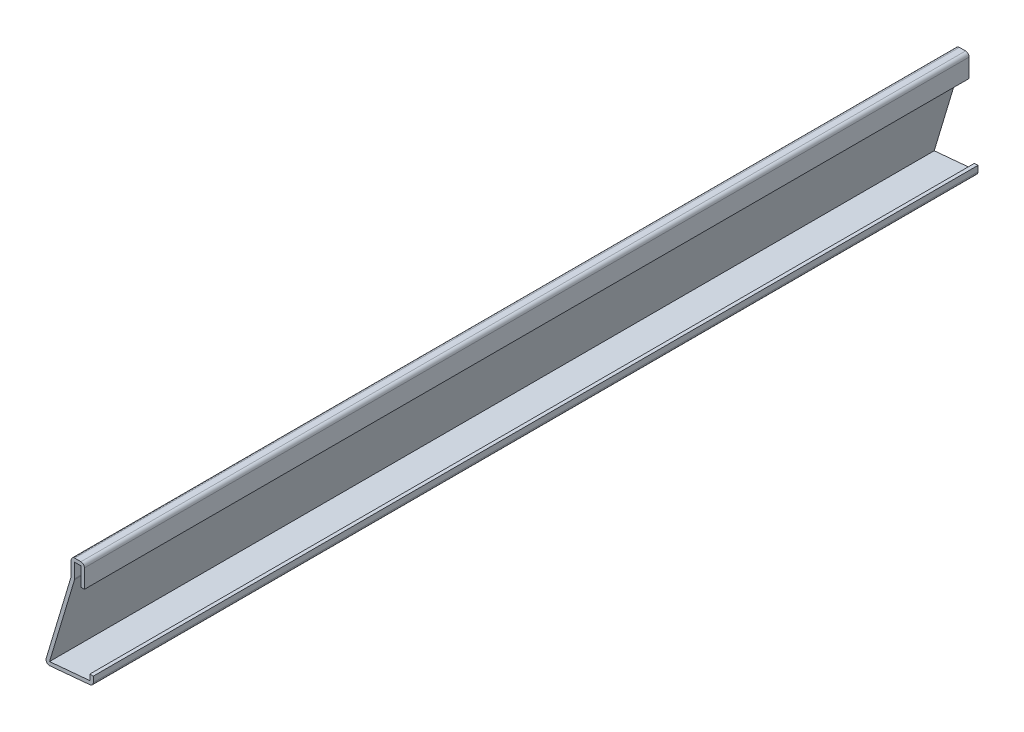
ISO-10303-21;
HEADER;
FILE_DESCRIPTION(('STEP AP214'),'2;1');
FILE_NAME('part.step','',(''),(''),'','','');
FILE_SCHEMA(('AUTOMOTIVE_DESIGN { 1 0 10303 214 1 1 1 1 }'));
ENDSEC;
DATA;
#1=APPLICATION_CONTEXT('core data for automotive mechanical design processes');
#2=APPLICATION_PROTOCOL_DEFINITION('international standard','automotive_design',2000,#1);
#3=PRODUCT_CONTEXT('',#1,'mechanical');
#4=PRODUCT('Part','Part','',(#3));
#5=PRODUCT_RELATED_PRODUCT_CATEGORY('part','',(#4));
#6=PRODUCT_DEFINITION_FORMATION('','',#4);
#7=PRODUCT_DEFINITION_CONTEXT('part definition',#1,'design');
#8=PRODUCT_DEFINITION('design','',#6,#7);
#9=PRODUCT_DEFINITION_SHAPE('','',#8);
#10=(LENGTH_UNIT() NAMED_UNIT(*) SI_UNIT(.MILLI.,.METRE.));
#11=(NAMED_UNIT(*) PLANE_ANGLE_UNIT() SI_UNIT($,.RADIAN.));
#12=(NAMED_UNIT(*) SI_UNIT($,.STERADIAN.) SOLID_ANGLE_UNIT());
#13=UNCERTAINTY_MEASURE_WITH_UNIT(LENGTH_MEASURE(1.E-05),#10,'distance_accuracy_value','');
#14=(GEOMETRIC_REPRESENTATION_CONTEXT(3) GLOBAL_UNCERTAINTY_ASSIGNED_CONTEXT((#13)) GLOBAL_UNIT_ASSIGNED_CONTEXT((#10,
#11,#12)) REPRESENTATION_CONTEXT('',''));
#15=CARTESIAN_POINT('',(0.,0.,0.));
#16=DIRECTION('',(0.,0.,1.));
#17=DIRECTION('',(1.,0.,0.));
#18=AXIS2_PLACEMENT_3D('',#15,#16,#17);
#19=CARTESIAN_POINT('',(-4.445,38.1,-317.5));
#20=DIRECTION('',(-1.,0.,0.));
#21=DIRECTION('',(0.,0.,1.));
#22=AXIS2_PLACEMENT_3D('',#19,#20,#21);
#23=PLANE('',#22);
#24=DIRECTION('',(0.,1.,0.));
#25=VECTOR('',#24,1.);
#26=CARTESIAN_POINT('',(-4.445,38.1,0.));
#27=LINE('',#26,#25);
#28=CARTESIAN_POINT('',(-4.445,36.83,0.));
#29=VERTEX_POINT('',#28);
#30=CARTESIAN_POINT('',(-4.445,30.1625,0.));
#31=VERTEX_POINT('',#30);
#32=EDGE_CURVE('E225',#29,#31,#27,.F.);
#33=ORIENTED_EDGE('',*,*,#32,.F.);
#34=DIRECTION('',(0.,0.,1.));
#35=VECTOR('',#34,1.);
#36=CARTESIAN_POINT('',(-4.445,36.83,-317.5));
#37=LINE('',#36,#35);
#38=CARTESIAN_POINT('',(-4.445,36.83,-317.5));
#39=VERTEX_POINT('',#38);
#40=EDGE_CURVE('E191',#39,#29,#37,.T.);
#41=ORIENTED_EDGE('',*,*,#40,.F.);
#42=DIRECTION('',(0.,1.,0.));
#43=VECTOR('',#42,1.);
#44=CARTESIAN_POINT('',(-4.445,38.1,-317.5));
#45=LINE('',#44,#43);
#46=CARTESIAN_POINT('',(-4.445,30.1625,-317.5));
#47=VERTEX_POINT('',#46);
#48=EDGE_CURVE('E173',#39,#47,#45,.F.);
#49=ORIENTED_EDGE('',*,*,#48,.T.);
#50=DIRECTION('',(0.,0.,1.));
#51=VECTOR('',#50,1.);
#52=CARTESIAN_POINT('',(-4.445,30.1625,-317.5));
#53=LINE('',#52,#51);
#54=EDGE_CURVE('E181',#47,#31,#53,.T.);
#55=ORIENTED_EDGE('',*,*,#54,.T.);
#56=EDGE_LOOP('',(#33,#41,#49,#55));
#57=FACE_BOUND('',#56,.T.);
#58=ADVANCED_FACE('F35',(#57),#23,.T.);
#59=CARTESIAN_POINT('',(-7.9375,36.83,-317.5));
#60=DIRECTION('',(0.,-1.,0.));
#61=DIRECTION('',(0.,0.,-1.));
#62=AXIS2_PLACEMENT_3D('',#59,#60,#61);
#63=PLANE('',#62);
#64=DIRECTION('',(1.,0.,0.));
#65=VECTOR('',#64,1.);
#66=CARTESIAN_POINT('',(-7.9375,36.83,0.));
#67=LINE('',#66,#65);
#68=CARTESIAN_POINT('',(-6.6675,36.83,0.));
#69=VERTEX_POINT('',#68);
#70=EDGE_CURVE('E192',#69,#29,#67,.T.);
#71=ORIENTED_EDGE('',*,*,#70,.F.);
#72=DIRECTION('',(0.,0.,1.));
#73=VECTOR('',#72,1.);
#74=CARTESIAN_POINT('',(-6.6675,36.83,-317.5));
#75=LINE('',#74,#73);
#76=CARTESIAN_POINT('',(-6.6675,36.83,-317.5));
#77=VERTEX_POINT('',#76);
#78=EDGE_CURVE('E257',#77,#69,#75,.T.);
#79=ORIENTED_EDGE('',*,*,#78,.F.);
#80=DIRECTION('',(1.,0.,0.));
#81=VECTOR('',#80,1.);
#82=CARTESIAN_POINT('',(-7.9375,36.83,-317.5));
#83=LINE('',#82,#81);
#84=EDGE_CURVE('E189',#77,#39,#83,.T.);
#85=ORIENTED_EDGE('',*,*,#84,.T.);
#86=ORIENTED_EDGE('',*,*,#40,.T.);
#87=EDGE_LOOP('',(#71,#79,#85,#86));
#88=FACE_BOUND('',#87,.T.);
#89=ADVANCED_FACE('F334',(#88),#63,.T.);
#90=CARTESIAN_POINT('',(-6.6675,31.75,-317.5));
#91=DIRECTION('',(1.,0.,0.));
#92=DIRECTION('',(0.,0.,-1.));
#93=AXIS2_PLACEMENT_3D('',#90,#91,#92);
#94=PLANE('',#93);
#95=DIRECTION('',(0.,1.,0.));
#96=VECTOR('',#95,1.);
#97=CARTESIAN_POINT('',(-6.6675,31.75,0.));
#98=LINE('',#97,#96);
#99=CARTESIAN_POINT('',(-6.6675,31.75,0.));
#100=VERTEX_POINT('',#99);
#101=EDGE_CURVE('E195',#100,#69,#98,.T.);
#102=ORIENTED_EDGE('',*,*,#101,.F.);
#103=DIRECTION('',(0.,0.,1.));
#104=VECTOR('',#103,1.);
#105=CARTESIAN_POINT('',(-6.6675,31.75,-317.5));
#106=LINE('',#105,#104);
#107=CARTESIAN_POINT('',(-6.6675,31.75,-317.5));
#108=VERTEX_POINT('',#107);
#109=EDGE_CURVE('E304',#100,#108,#106,.F.);
#110=ORIENTED_EDGE('',*,*,#109,.T.);
#111=DIRECTION('',(0.,1.,0.));
#112=VECTOR('',#111,1.);
#113=CARTESIAN_POINT('',(-6.6675,31.75,-317.5));
#114=LINE('',#113,#112);
#115=EDGE_CURVE('E222',#108,#77,#114,.T.);
#116=ORIENTED_EDGE('',*,*,#115,.T.);
#117=ORIENTED_EDGE('',*,*,#78,.T.);
#118=EDGE_LOOP('',(#102,#110,#116,#117));
#119=FACE_BOUND('',#118,.T.);
#120=ADVANCED_FACE('F392',(#119),#94,.T.);
#121=CARTESIAN_POINT('',(-16.2460606177691,-0.364931814669259,-317.5));
#122=DIRECTION('',(0.957826285221151,-0.287347885566345,0.));
#123=DIRECTION('',(0.287347885566345,0.957826285221151,0.));
#124=AXIS2_PLACEMENT_3D('',#121,#122,#123);
#125=PLANE('',#124);
#126=DIRECTION('',(0.287347885566345,0.957826285221152,0.));
#127=VECTOR('',#126,1.);
#128=CARTESIAN_POINT('',(-16.2460606177691,-0.364931814669259,-317.5));
#129=LINE('',#128,#127);
#130=CARTESIAN_POINT('',(-15.7061083420097,1.43490910452892,-317.5));
#131=VERTEX_POINT('',#130);
#132=CARTESIAN_POINT('',(-6.72106061776914,31.3850681853308,-317.5));
#133=VERTEX_POINT('',#132);
#134=EDGE_CURVE('E219',#131,#133,#129,.T.);
#135=ORIENTED_EDGE('',*,*,#134,.T.);
#136=DIRECTION('',(0.,0.,1.));
#137=VECTOR('',#136,1.);
#138=CARTESIAN_POINT('',(-6.72106061776914,31.3850681853307,-317.5));
#139=LINE('',#138,#137);
#140=CARTESIAN_POINT('',(-6.72106061776914,31.3850681853308,0.));
#141=VERTEX_POINT('',#140);
#142=EDGE_CURVE('E301',#133,#141,#139,.T.);
#143=ORIENTED_EDGE('',*,*,#142,.T.);
#144=DIRECTION('',(0.287347885566345,0.957826285221152,0.));
#145=VECTOR('',#144,1.);
#146=CARTESIAN_POINT('',(-16.2460606177691,-0.364931814669259,0.));
#147=LINE('',#146,#145);
#148=CARTESIAN_POINT('',(-15.7061083420097,1.43490910452892,0.));
#149=VERTEX_POINT('',#148);
#150=EDGE_CURVE('E251',#149,#141,#147,.T.);
#151=ORIENTED_EDGE('',*,*,#150,.F.);
#152=DIRECTION('',(0.,0.,1.));
#153=VECTOR('',#152,1.);
#154=CARTESIAN_POINT('',(-15.7061083420097,1.43490910452892,-317.5));
#155=LINE('',#154,#153);
#156=EDGE_CURVE('E260',#131,#149,#155,.T.);
#157=ORIENTED_EDGE('',*,*,#156,.F.);
#158=EDGE_LOOP('',(#135,#143,#151,#157));
#159=FACE_BOUND('',#158,.T.);
#160=ADVANCED_FACE('F345',(#159),#125,.T.);
#161=CARTESIAN_POINT('',(-0.114980397473999,2.85228437221398,-317.5));
#162=DIRECTION('',(-0.0905357460425185,0.995893206467704,0.));
#163=DIRECTION('',(-0.995893206467704,-0.0905357460425185,0.));
#164=AXIS2_PLACEMENT_3D('',#161,#162,#163);
#165=PLANE('',#164);
#166=DIRECTION('',(-0.995893206467704,-0.0905357460425185,0.));
#167=VECTOR('',#166,1.);
#168=CARTESIAN_POINT('',(-0.114980397473999,2.85228437221398,0.));
#169=LINE('',#168,#167);
#170=CARTESIAN_POINT('',(-1.27,2.74728259016617,0.));
#171=VERTEX_POINT('',#170);
#172=EDGE_CURVE('E248',#171,#149,#169,.T.);
#173=ORIENTED_EDGE('',*,*,#172,.F.);
#174=DIRECTION('',(0.,0.,1.));
#175=VECTOR('',#174,1.);
#176=CARTESIAN_POINT('',(-1.27,2.74728259016617,-317.5));
#177=LINE('',#176,#175);
#178=CARTESIAN_POINT('',(-1.27,2.74728259016617,-317.5));
#179=VERTEX_POINT('',#178);
#180=EDGE_CURVE('E262',#179,#171,#177,.T.);
#181=ORIENTED_EDGE('',*,*,#180,.F.);
#182=DIRECTION('',(-0.995893206467704,-0.0905357460425185,0.));
#183=VECTOR('',#182,1.);
#184=CARTESIAN_POINT('',(-0.114980397473999,2.85228437221398,-317.5));
#185=LINE('',#184,#183);
#186=EDGE_CURVE('E216',#179,#131,#185,.T.);
#187=ORIENTED_EDGE('',*,*,#186,.T.);
#188=ORIENTED_EDGE('',*,*,#156,.T.);
#189=EDGE_LOOP('',(#173,#181,#187,#188));
#190=FACE_BOUND('',#189,.T.);
#191=ADVANCED_FACE('F350',(#190),#165,.T.);
#192=CARTESIAN_POINT('',(-1.27,4.7625,-317.5));
#193=DIRECTION('',(-1.,0.,0.));
#194=DIRECTION('',(0.,-1.,0.));
#195=AXIS2_PLACEMENT_3D('',#192,#193,#194);
#196=PLANE('',#195);
#197=DIRECTION('',(0.,-1.,0.));
#198=VECTOR('',#197,1.);
#199=CARTESIAN_POINT('',(-1.27,4.7625,0.));
#200=LINE('',#199,#198);
#201=CARTESIAN_POINT('',(-1.27,4.7625,0.));
#202=VERTEX_POINT('',#201);
#203=EDGE_CURVE('E245',#202,#171,#200,.T.);
#204=ORIENTED_EDGE('',*,*,#203,.F.);
#205=DIRECTION('',(0.,0.,1.));
#206=VECTOR('',#205,1.);
#207=CARTESIAN_POINT('',(-1.27,4.7625,-317.5));
#208=LINE('',#207,#206);
#209=CARTESIAN_POINT('',(-1.27,4.7625,-317.5));
#210=VERTEX_POINT('',#209);
#211=EDGE_CURVE('E264',#210,#202,#208,.T.);
#212=ORIENTED_EDGE('',*,*,#211,.F.);
#213=DIRECTION('',(0.,-1.,0.));
#214=VECTOR('',#213,1.);
#215=CARTESIAN_POINT('',(-1.27,4.7625,-317.5));
#216=LINE('',#215,#214);
#217=EDGE_CURVE('E213',#210,#179,#216,.T.);
#218=ORIENTED_EDGE('',*,*,#217,.T.);
#219=ORIENTED_EDGE('',*,*,#180,.T.);
#220=EDGE_LOOP('',(#204,#212,#218,#219));
#221=FACE_BOUND('',#220,.T.);
#222=ADVANCED_FACE('F354',(#221),#196,.T.);
#223=CARTESIAN_POINT('',(-1.27,4.7625,-317.5));
#224=DIRECTION('',(0.,-1.,0.));
#225=DIRECTION('',(0.,0.,-1.));
#226=AXIS2_PLACEMENT_3D('',#223,#224,#225);
#227=PLANE('',#226);
#228=DIRECTION('',(1.,0.,0.));
#229=VECTOR('',#228,1.);
#230=CARTESIAN_POINT('',(-1.27,4.7625,0.));
#231=LINE('',#230,#229);
#232=CARTESIAN_POINT('',(0.,4.7625,0.));
#233=VERTEX_POINT('',#232);
#234=EDGE_CURVE('E243',#202,#233,#231,.T.);
#235=ORIENTED_EDGE('',*,*,#234,.T.);
#236=DIRECTION('',(0.,0.,1.));
#237=VECTOR('',#236,1.);
#238=CARTESIAN_POINT('',(0.,4.7625,-317.5));
#239=LINE('',#238,#237);
#240=CARTESIAN_POINT('',(0.,4.7625,-317.5));
#241=VERTEX_POINT('',#240);
#242=EDGE_CURVE('E266',#241,#233,#239,.T.);
#243=ORIENTED_EDGE('',*,*,#242,.F.);
#244=DIRECTION('',(1.,0.,0.));
#245=VECTOR('',#244,1.);
#246=CARTESIAN_POINT('',(-1.27,4.7625,-317.5));
#247=LINE('',#246,#245);
#248=EDGE_CURVE('E211',#210,#241,#247,.T.);
#249=ORIENTED_EDGE('',*,*,#248,.F.);
#250=ORIENTED_EDGE('',*,*,#211,.T.);
#251=EDGE_LOOP('',(#235,#243,#249,#250));
#252=FACE_BOUND('',#251,.T.);
#253=ADVANCED_FACE('F358',(#252),#227,.F.);
#254=CARTESIAN_POINT('',(0.,4.7625,-317.5));
#255=DIRECTION('',(-1.,0.,0.));
#256=DIRECTION('',(0.,-1.,0.));
#257=AXIS2_PLACEMENT_3D('',#254,#255,#256);
#258=PLANE('',#257);
#259=DIRECTION('',(0.,-1.,0.));
#260=VECTOR('',#259,1.);
#261=CARTESIAN_POINT('',(0.,4.7625,0.));
#262=LINE('',#261,#260);
#263=CARTESIAN_POINT('',(0.,2.74728259016617,0.));
#264=VERTEX_POINT('',#263);
#265=EDGE_CURVE('E240',#233,#264,#262,.T.);
#266=ORIENTED_EDGE('',*,*,#265,.T.);
#267=DIRECTION('',(0.,0.,1.));
#268=VECTOR('',#267,1.);
#269=CARTESIAN_POINT('',(0.,2.74728259016617,-317.5));
#270=LINE('',#269,#268);
#271=CARTESIAN_POINT('',(0.,2.74728259016617,-317.5));
#272=VERTEX_POINT('',#271);
#273=EDGE_CURVE('E287',#264,#272,#270,.F.);
#274=ORIENTED_EDGE('',*,*,#273,.T.);
#275=DIRECTION('',(0.,-1.,0.));
#276=VECTOR('',#275,1.);
#277=CARTESIAN_POINT('',(0.,4.7625,-317.5));
#278=LINE('',#277,#276);
#279=EDGE_CURVE('E209',#241,#272,#278,.T.);
#280=ORIENTED_EDGE('',*,*,#279,.F.);
#281=ORIENTED_EDGE('',*,*,#242,.T.);
#282=EDGE_LOOP('',(#266,#274,#280,#281));
#283=FACE_BOUND('',#282,.T.);
#284=ADVANCED_FACE('F385',(#283),#258,.F.);
#285=CARTESIAN_POINT('',(0.,1.5875,-317.5));
#286=DIRECTION('',(-0.0905357460425185,0.995893206467704,0.));
#287=DIRECTION('',(-0.995893206467704,-0.0905357460425185,0.));
#288=AXIS2_PLACEMENT_3D('',#285,#286,#287);
#289=PLANE('',#288);
#290=DIRECTION('',(-0.995893206467704,-0.0905357460425185,0.));
#291=VECTOR('',#290,1.);
#292=CARTESIAN_POINT('',(0.,1.5875,-317.5));
#293=LINE('',#292,#291);
#294=CARTESIAN_POINT('',(-1.155019602526,1.48249821795218,-317.5));
#295=VERTEX_POINT('',#294);
#296=CARTESIAN_POINT('',(-15.5911279445357,0.170124732314937,-317.5));
#297=VERTEX_POINT('',#296);
#298=EDGE_CURVE('E206',#295,#297,#293,.T.);
#299=ORIENTED_EDGE('',*,*,#298,.F.);
#300=DIRECTION('',(0.,0.,1.));
#301=VECTOR('',#300,1.);
#302=CARTESIAN_POINT('',(-1.155019602526,1.48249821795218,-317.5));
#303=LINE('',#302,#301);
#304=CARTESIAN_POINT('',(-1.155019602526,1.48249821795218,0.));
#305=VERTEX_POINT('',#304);
#306=EDGE_CURVE('E274',#295,#305,#303,.T.);
#307=ORIENTED_EDGE('',*,*,#306,.T.);
#308=DIRECTION('',(-0.995893206467704,-0.0905357460425185,0.));
#309=VECTOR('',#308,1.);
#310=CARTESIAN_POINT('',(0.,1.5875,0.));
#311=LINE('',#310,#309);
#312=CARTESIAN_POINT('',(-15.5911279445357,0.170124732314937,0.));
#313=VERTEX_POINT('',#312);
#314=EDGE_CURVE('E237',#305,#313,#311,.T.);
#315=ORIENTED_EDGE('',*,*,#314,.T.);
#316=DIRECTION('',(0.,0.,1.));
#317=VECTOR('',#316,1.);
#318=CARTESIAN_POINT('',(-15.5911279445357,0.170124732314938,-317.5));
#319=LINE('',#318,#317);
#320=EDGE_CURVE('E256',#313,#297,#319,.F.);
#321=ORIENTED_EDGE('',*,*,#320,.T.);
#322=EDGE_LOOP('',(#299,#307,#315,#321));
#323=FACE_BOUND('',#322,.T.);
#324=ADVANCED_FACE('F368',(#323),#289,.F.);
#325=CARTESIAN_POINT('',(-17.4625,0.,-317.5));
#326=DIRECTION('',(0.957826285221151,-0.287347885566345,0.));
#327=DIRECTION('',(0.287347885566345,0.957826285221152,0.));
#328=AXIS2_PLACEMENT_3D('',#325,#326,#327);
#329=PLANE('',#328);
#330=DIRECTION('',(0.287347885566345,0.957826285221151,0.));
#331=VECTOR('',#330,1.);
#332=CARTESIAN_POINT('',(-17.4625,0.,-317.5));
#333=LINE('',#332,#331);
#334=CARTESIAN_POINT('',(-16.9225477242405,1.79984091919818,-317.5));
#335=VERTEX_POINT('',#334);
#336=CARTESIAN_POINT('',(-7.9375,31.75,-317.5));
#337=VERTEX_POINT('',#336);
#338=EDGE_CURVE('E204',#335,#337,#333,.T.);
#339=ORIENTED_EDGE('',*,*,#338,.F.);
#340=DIRECTION('',(0.,0.,1.));
#341=VECTOR('',#340,1.);
#342=CARTESIAN_POINT('',(-16.9225477242405,1.79984091919818,-317.5));
#343=LINE('',#342,#341);
#344=CARTESIAN_POINT('',(-16.9225477242405,1.79984091919818,0.));
#345=VERTEX_POINT('',#344);
#346=EDGE_CURVE('E298',#335,#345,#343,.T.);
#347=ORIENTED_EDGE('',*,*,#346,.T.);
#348=DIRECTION('',(0.287347885566345,0.957826285221151,0.));
#349=VECTOR('',#348,1.);
#350=CARTESIAN_POINT('',(-17.4625,0.,0.));
#351=LINE('',#350,#349);
#352=CARTESIAN_POINT('',(-7.9375,31.75,0.));
#353=VERTEX_POINT('',#352);
#354=EDGE_CURVE('E235',#345,#353,#351,.T.);
#355=ORIENTED_EDGE('',*,*,#354,.T.);
#356=DIRECTION('',(0.,0.,1.));
#357=VECTOR('',#356,1.);
#358=CARTESIAN_POINT('',(-7.9375,31.75,-317.5));
#359=LINE('',#358,#357);
#360=EDGE_CURVE('E269',#337,#353,#359,.T.);
#361=ORIENTED_EDGE('',*,*,#360,.F.);
#362=EDGE_LOOP('',(#339,#347,#355,#361));
#363=FACE_BOUND('',#362,.T.);
#364=ADVANCED_FACE('F377',(#363),#329,.F.);
#365=CARTESIAN_POINT('',(-7.9375,31.75,-317.5));
#366=DIRECTION('',(1.,0.,0.));
#367=DIRECTION('',(0.,0.,-1.));
#368=AXIS2_PLACEMENT_3D('',#365,#366,#367);
#369=PLANE('',#368);
#370=DIRECTION('',(0.,1.,0.));
#371=VECTOR('',#370,1.);
#372=CARTESIAN_POINT('',(-7.9375,31.75,0.));
#373=LINE('',#372,#371);
#374=CARTESIAN_POINT('',(-7.9375,36.83,0.));
#375=VERTEX_POINT('',#374);
#376=EDGE_CURVE('E232',#353,#375,#373,.T.);
#377=ORIENTED_EDGE('',*,*,#376,.T.);
#378=DIRECTION('',(0.,0.,1.));
#379=VECTOR('',#378,1.);
#380=CARTESIAN_POINT('',(-7.9375,36.83,-317.5));
#381=LINE('',#380,#379);
#382=CARTESIAN_POINT('',(-7.9375,36.83,-317.5));
#383=VERTEX_POINT('',#382);
#384=EDGE_CURVE('E43',#375,#383,#381,.F.);
#385=ORIENTED_EDGE('',*,*,#384,.T.);
#386=DIRECTION('',(0.,1.,0.));
#387=VECTOR('',#386,1.);
#388=CARTESIAN_POINT('',(-7.9375,31.75,-317.5));
#389=LINE('',#388,#387);
#390=EDGE_CURVE('E201',#337,#383,#389,.T.);
#391=ORIENTED_EDGE('',*,*,#390,.F.);
#392=ORIENTED_EDGE('',*,*,#360,.T.);
#393=EDGE_LOOP('',(#377,#385,#391,#392));
#394=FACE_BOUND('',#393,.T.);
#395=ADVANCED_FACE('F312',(#394),#369,.F.);
#396=CARTESIAN_POINT('',(-7.9375,38.1,-317.5));
#397=DIRECTION('',(0.,-1.,0.));
#398=DIRECTION('',(0.,0.,-1.));
#399=AXIS2_PLACEMENT_3D('',#396,#397,#398);
#400=PLANE('',#399);
#401=DIRECTION('',(1.,0.,0.));
#402=VECTOR('',#401,1.);
#403=CARTESIAN_POINT('',(-7.9375,38.1,-317.5));
#404=LINE('',#403,#402);
#405=CARTESIAN_POINT('',(-6.6675,38.1,-317.5));
#406=VERTEX_POINT('',#405);
#407=CARTESIAN_POINT('',(-4.445,38.1,-317.5));
#408=VERTEX_POINT('',#407);
#409=EDGE_CURVE('E199',#406,#408,#404,.T.);
#410=ORIENTED_EDGE('',*,*,#409,.F.);
#411=DIRECTION('',(0.,0.,1.));
#412=VECTOR('',#411,1.);
#413=CARTESIAN_POINT('',(-6.6675,38.1,-317.5));
#414=LINE('',#413,#412);
#415=CARTESIAN_POINT('',(-6.6675,38.1,0.));
#416=VERTEX_POINT('',#415);
#417=EDGE_CURVE('E307',#406,#416,#414,.T.);
#418=ORIENTED_EDGE('',*,*,#417,.T.);
#419=DIRECTION('',(1.,0.,0.));
#420=VECTOR('',#419,1.);
#421=CARTESIAN_POINT('',(-7.9375,38.1,0.));
#422=LINE('',#421,#420);
#423=CARTESIAN_POINT('',(-4.445,38.1,0.));
#424=VERTEX_POINT('',#423);
#425=EDGE_CURVE('E230',#416,#424,#422,.T.);
#426=ORIENTED_EDGE('',*,*,#425,.T.);
#427=DIRECTION('',(0.,0.,1.));
#428=VECTOR('',#427,1.);
#429=CARTESIAN_POINT('',(-4.445,38.1,-317.5));
#430=LINE('',#429,#428);
#431=EDGE_CURVE('E58',#424,#408,#430,.F.);
#432=ORIENTED_EDGE('',*,*,#431,.T.);
#433=EDGE_LOOP('',(#410,#418,#426,#432));
#434=FACE_BOUND('',#433,.T.);
#435=ADVANCED_FACE('F321',(#434),#400,.F.);
#436=CARTESIAN_POINT('',(-3.175,38.1,-317.5));
#437=DIRECTION('',(-1.,0.,0.));
#438=DIRECTION('',(0.,0.,1.));
#439=AXIS2_PLACEMENT_3D('',#436,#437,#438);
#440=PLANE('',#439);
#441=DIRECTION('',(0.,-1.,0.));
#442=VECTOR('',#441,1.);
#443=CARTESIAN_POINT('',(-3.175,38.1,-317.5));
#444=LINE('',#443,#442);
#445=CARTESIAN_POINT('',(-3.175,36.83,-317.5));
#446=VERTEX_POINT('',#445);
#447=CARTESIAN_POINT('',(-3.175,30.1625,-317.5));
#448=VERTEX_POINT('',#447);
#449=EDGE_CURVE('E175',#446,#448,#444,.T.);
#450=ORIENTED_EDGE('',*,*,#449,.F.);
#451=DIRECTION('',(0.,0.,1.));
#452=VECTOR('',#451,1.);
#453=CARTESIAN_POINT('',(-3.175,36.83,-317.5));
#454=LINE('',#453,#452);
#455=CARTESIAN_POINT('',(-3.175,36.83,0.));
#456=VERTEX_POINT('',#455);
#457=EDGE_CURVE('E11',#446,#456,#454,.T.);
#458=ORIENTED_EDGE('',*,*,#457,.T.);
#459=DIRECTION('',(0.,-1.,0.));
#460=VECTOR('',#459,1.);
#461=CARTESIAN_POINT('',(-3.175,38.1,0.));
#462=LINE('',#461,#460);
#463=CARTESIAN_POINT('',(-3.175,30.1625,0.));
#464=VERTEX_POINT('',#463);
#465=EDGE_CURVE('E228',#456,#464,#462,.T.);
#466=ORIENTED_EDGE('',*,*,#465,.T.);
#467=DIRECTION('',(0.,0.,1.));
#468=VECTOR('',#467,1.);
#469=CARTESIAN_POINT('',(-3.175,30.1625,-317.5));
#470=LINE('',#469,#468);
#471=EDGE_CURVE('E188',#448,#464,#470,.T.);
#472=ORIENTED_EDGE('',*,*,#471,.F.);
#473=EDGE_LOOP('',(#450,#458,#466,#472));
#474=FACE_BOUND('',#473,.T.);
#475=ADVANCED_FACE('F329',(#474),#440,.F.);
#476=CARTESIAN_POINT('',(-3.175,30.1625,-317.5));
#477=DIRECTION('',(0.,1.,0.));
#478=DIRECTION('',(0.,0.,1.));
#479=AXIS2_PLACEMENT_3D('',#476,#477,#478);
#480=PLANE('',#479);
#481=DIRECTION('',(-1.,0.,0.));
#482=VECTOR('',#481,1.);
#483=CARTESIAN_POINT('',(-3.175,30.1625,0.));
#484=LINE('',#483,#482);
#485=EDGE_CURVE('E184',#464,#31,#484,.T.);
#486=ORIENTED_EDGE('',*,*,#485,.T.);
#487=ORIENTED_EDGE('',*,*,#54,.F.);
#488=DIRECTION('',(-1.,0.,0.));
#489=VECTOR('',#488,1.);
#490=CARTESIAN_POINT('',(-3.175,30.1625,-317.5));
#491=LINE('',#490,#489);
#492=EDGE_CURVE('E167',#448,#47,#491,.T.);
#493=ORIENTED_EDGE('',*,*,#492,.F.);
#494=ORIENTED_EDGE('',*,*,#471,.T.);
#495=EDGE_LOOP('',(#486,#487,#493,#494));
#496=FACE_BOUND('',#495,.T.);
#497=ADVANCED_FACE('F182',(#496),#480,.F.);
#498=CARTESIAN_POINT('',(0.,0.,-317.5));
#499=DIRECTION('',(0.,0.,1.));
#500=DIRECTION('',(1.,0.,0.));
#501=AXIS2_PLACEMENT_3D('',#498,#499,#500);
#502=PLANE('',#501);
#503=ORIENTED_EDGE('',*,*,#279,.T.);
#504=CARTESIAN_POINT('',(-1.27,2.74728259016617,-317.5));
#505=DIRECTION('',(0.,0.,1.));
#506=DIRECTION('',(1.,0.,0.));
#507=AXIS2_PLACEMENT_3D('',#504,#505,#506);
#508=CIRCLE('',#507,1.27);
#509=EDGE_CURVE('E296',#272,#295,#508,.F.);
#510=ORIENTED_EDGE('',*,*,#509,.T.);
#511=ORIENTED_EDGE('',*,*,#298,.T.);
#512=CARTESIAN_POINT('',(-15.7061083420097,1.43490910452892,-317.5));
#513=DIRECTION('',(0.,0.,1.));
#514=DIRECTION('',(1.,0.,0.));
#515=AXIS2_PLACEMENT_3D('',#512,#513,#514);
#516=CIRCLE('',#515,1.27);
#517=EDGE_CURVE('E294',#297,#335,#516,.F.);
#518=ORIENTED_EDGE('',*,*,#517,.T.);
#519=ORIENTED_EDGE('',*,*,#338,.T.);
#520=ORIENTED_EDGE('',*,*,#390,.T.);
#521=CARTESIAN_POINT('',(-6.6675,36.83,-317.5));
#522=DIRECTION('',(0.,0.,1.));
#523=DIRECTION('',(1.,0.,0.));
#524=AXIS2_PLACEMENT_3D('',#521,#522,#523);
#525=CIRCLE('',#524,1.27);
#526=EDGE_CURVE('E290',#383,#406,#525,.F.);
#527=ORIENTED_EDGE('',*,*,#526,.T.);
#528=ORIENTED_EDGE('',*,*,#409,.T.);
#529=CARTESIAN_POINT('',(-4.445,36.83,-317.5));
#530=DIRECTION('',(0.,0.,1.));
#531=DIRECTION('',(1.,0.,0.));
#532=AXIS2_PLACEMENT_3D('',#529,#530,#531);
#533=CIRCLE('',#532,1.27);
#534=EDGE_CURVE('E50',#408,#446,#533,.F.);
#535=ORIENTED_EDGE('',*,*,#534,.T.);
#536=ORIENTED_EDGE('',*,*,#449,.T.);
#537=ORIENTED_EDGE('',*,*,#492,.T.);
#538=ORIENTED_EDGE('',*,*,#48,.F.);
#539=ORIENTED_EDGE('',*,*,#84,.F.);
#540=ORIENTED_EDGE('',*,*,#115,.F.);
#541=CARTESIAN_POINT('',(-7.9375,31.75,-317.5));
#542=DIRECTION('',(0.,0.,1.));
#543=DIRECTION('',(1.,0.,0.));
#544=AXIS2_PLACEMENT_3D('',#541,#542,#543);
#545=CIRCLE('',#544,1.27);
#546=EDGE_CURVE('E292',#108,#133,#545,.F.);
#547=ORIENTED_EDGE('',*,*,#546,.T.);
#548=ORIENTED_EDGE('',*,*,#134,.F.);
#549=ORIENTED_EDGE('',*,*,#186,.F.);
#550=ORIENTED_EDGE('',*,*,#217,.F.);
#551=ORIENTED_EDGE('',*,*,#248,.T.);
#552=EDGE_LOOP('',(#503,#510,#511,#518,#519,#520,#527,#528,#535,#536,#537,#538,#539,#540,#547,
#548,#549,#550,#551));
#553=FACE_BOUND('',#552,.T.);
#554=ADVANCED_FACE('F170',(#553),#502,.F.);
#555=CARTESIAN_POINT('',(0.,0.,0.));
#556=DIRECTION('',(0.,0.,1.));
#557=DIRECTION('',(1.,0.,0.));
#558=AXIS2_PLACEMENT_3D('',#555,#556,#557);
#559=PLANE('',#558);
#560=ORIENTED_EDGE('',*,*,#314,.F.);
#561=CARTESIAN_POINT('',(-1.27,2.74728259016617,0.));
#562=DIRECTION('',(0.,0.,1.));
#563=DIRECTION('',(1.,0.,0.));
#564=AXIS2_PLACEMENT_3D('',#561,#562,#563);
#565=CIRCLE('',#564,1.27);
#566=EDGE_CURVE('E285',#305,#264,#565,.T.);
#567=ORIENTED_EDGE('',*,*,#566,.T.);
#568=ORIENTED_EDGE('',*,*,#265,.F.);
#569=ORIENTED_EDGE('',*,*,#234,.F.);
#570=ORIENTED_EDGE('',*,*,#203,.T.);
#571=ORIENTED_EDGE('',*,*,#172,.T.);
#572=ORIENTED_EDGE('',*,*,#150,.T.);
#573=CARTESIAN_POINT('',(-7.9375,31.75,0.));
#574=DIRECTION('',(0.,0.,1.));
#575=DIRECTION('',(1.,0.,0.));
#576=AXIS2_PLACEMENT_3D('',#573,#574,#575);
#577=CIRCLE('',#576,1.27);
#578=EDGE_CURVE('E281',#141,#100,#577,.T.);
#579=ORIENTED_EDGE('',*,*,#578,.T.);
#580=ORIENTED_EDGE('',*,*,#101,.T.);
#581=ORIENTED_EDGE('',*,*,#70,.T.);
#582=ORIENTED_EDGE('',*,*,#32,.T.);
#583=ORIENTED_EDGE('',*,*,#485,.F.);
#584=ORIENTED_EDGE('',*,*,#465,.F.);
#585=CARTESIAN_POINT('',(-4.445,36.83,0.));
#586=DIRECTION('',(0.,0.,1.));
#587=DIRECTION('',(1.,0.,0.));
#588=AXIS2_PLACEMENT_3D('',#585,#586,#587);
#589=CIRCLE('',#588,1.27);
#590=EDGE_CURVE('E277',#456,#424,#589,.T.);
#591=ORIENTED_EDGE('',*,*,#590,.T.);
#592=ORIENTED_EDGE('',*,*,#425,.F.);
#593=CARTESIAN_POINT('',(-6.6675,36.83,0.));
#594=DIRECTION('',(0.,0.,1.));
#595=DIRECTION('',(1.,0.,0.));
#596=AXIS2_PLACEMENT_3D('',#593,#594,#595);
#597=CIRCLE('',#596,1.27);
#598=EDGE_CURVE('E279',#416,#375,#597,.T.);
#599=ORIENTED_EDGE('',*,*,#598,.T.);
#600=ORIENTED_EDGE('',*,*,#376,.F.);
#601=ORIENTED_EDGE('',*,*,#354,.F.);
#602=CARTESIAN_POINT('',(-15.7061083420097,1.43490910452892,0.));
#603=DIRECTION('',(0.,0.,1.));
#604=DIRECTION('',(1.,0.,0.));
#605=AXIS2_PLACEMENT_3D('',#602,#603,#604);
#606=CIRCLE('',#605,1.27);
#607=EDGE_CURVE('E283',#345,#313,#606,.T.);
#608=ORIENTED_EDGE('',*,*,#607,.T.);
#609=EDGE_LOOP('',(#560,#567,#568,#569,#570,#571,#572,#579,#580,#581,#582,#583,#584,#591,#592,
#599,#600,#601,#608));
#610=FACE_BOUND('',#609,.T.);
#611=ADVANCED_FACE('F324',(#610),#559,.T.);
#612=CARTESIAN_POINT('',(-1.27,2.74728259016617,-317.5));
#613=DIRECTION('',(0.,0.,1.));
#614=DIRECTION('',(1.,0.,0.));
#615=AXIS2_PLACEMENT_3D('',#612,#613,#614);
#616=CYLINDRICAL_SURFACE('',#615,1.27);
#617=ORIENTED_EDGE('',*,*,#509,.F.);
#618=ORIENTED_EDGE('',*,*,#273,.F.);
#619=ORIENTED_EDGE('',*,*,#566,.F.);
#620=ORIENTED_EDGE('',*,*,#306,.F.);
#621=EDGE_LOOP('',(#617,#618,#619,#620));
#622=FACE_BOUND('',#621,.T.);
#623=ADVANCED_FACE('F366',(#622),#616,.T.);
#624=CARTESIAN_POINT('',(-15.7061083420097,1.43490910452892,-317.5));
#625=DIRECTION('',(0.,0.,1.));
#626=DIRECTION('',(1.,0.,0.));
#627=AXIS2_PLACEMENT_3D('',#624,#625,#626);
#628=CYLINDRICAL_SURFACE('',#627,1.27);
#629=ORIENTED_EDGE('',*,*,#517,.F.);
#630=ORIENTED_EDGE('',*,*,#320,.F.);
#631=ORIENTED_EDGE('',*,*,#607,.F.);
#632=ORIENTED_EDGE('',*,*,#346,.F.);
#633=EDGE_LOOP('',(#629,#630,#631,#632));
#634=FACE_BOUND('',#633,.T.);
#635=ADVANCED_FACE('F375',(#634),#628,.T.);
#636=CARTESIAN_POINT('',(-7.9375,31.75,-317.5));
#637=DIRECTION('',(0.,0.,1.));
#638=DIRECTION('',(1.,0.,0.));
#639=AXIS2_PLACEMENT_3D('',#636,#637,#638);
#640=CYLINDRICAL_SURFACE('',#639,1.27);
#641=ORIENTED_EDGE('',*,*,#546,.F.);
#642=ORIENTED_EDGE('',*,*,#109,.F.);
#643=ORIENTED_EDGE('',*,*,#578,.F.);
#644=ORIENTED_EDGE('',*,*,#142,.F.);
#645=EDGE_LOOP('',(#641,#642,#643,#644));
#646=FACE_BOUND('',#645,.T.);
#647=ADVANCED_FACE('F342',(#646),#640,.T.);
#648=CARTESIAN_POINT('',(-6.6675,36.83,-317.5));
#649=DIRECTION('',(0.,0.,1.));
#650=DIRECTION('',(1.,0.,0.));
#651=AXIS2_PLACEMENT_3D('',#648,#649,#650);
#652=CYLINDRICAL_SURFACE('',#651,1.27);
#653=ORIENTED_EDGE('',*,*,#526,.F.);
#654=ORIENTED_EDGE('',*,*,#384,.F.);
#655=ORIENTED_EDGE('',*,*,#598,.F.);
#656=ORIENTED_EDGE('',*,*,#417,.F.);
#657=EDGE_LOOP('',(#653,#654,#655,#656));
#658=FACE_BOUND('',#657,.T.);
#659=ADVANCED_FACE('F319',(#658),#652,.T.);
#660=CARTESIAN_POINT('',(-4.445,36.83,-317.5));
#661=DIRECTION('',(0.,0.,1.));
#662=DIRECTION('',(1.,0.,0.));
#663=AXIS2_PLACEMENT_3D('',#660,#661,#662);
#664=CYLINDRICAL_SURFACE('',#663,1.27);
#665=ORIENTED_EDGE('',*,*,#534,.F.);
#666=ORIENTED_EDGE('',*,*,#431,.F.);
#667=ORIENTED_EDGE('',*,*,#590,.F.);
#668=ORIENTED_EDGE('',*,*,#457,.F.);
#669=EDGE_LOOP('',(#665,#666,#667,#668));
#670=FACE_BOUND('',#669,.T.);
#671=ADVANCED_FACE('F37',(#670),#664,.T.);
#672=CLOSED_SHELL('',(#58,#89,#120,#160,#191,#222,#253,#284,#324,#364,#395,#435,#475,#497,#554,
#611,#623,#635,#647,#659,#671));
#673=MANIFOLD_SOLID_BREP('B2',#672);
#674=ADVANCED_BREP_SHAPE_REPRESENTATION('',(#18,#673),#14);
#675=SHAPE_DEFINITION_REPRESENTATION(#9,#674);
ENDSEC;
END-ISO-10303-21;
